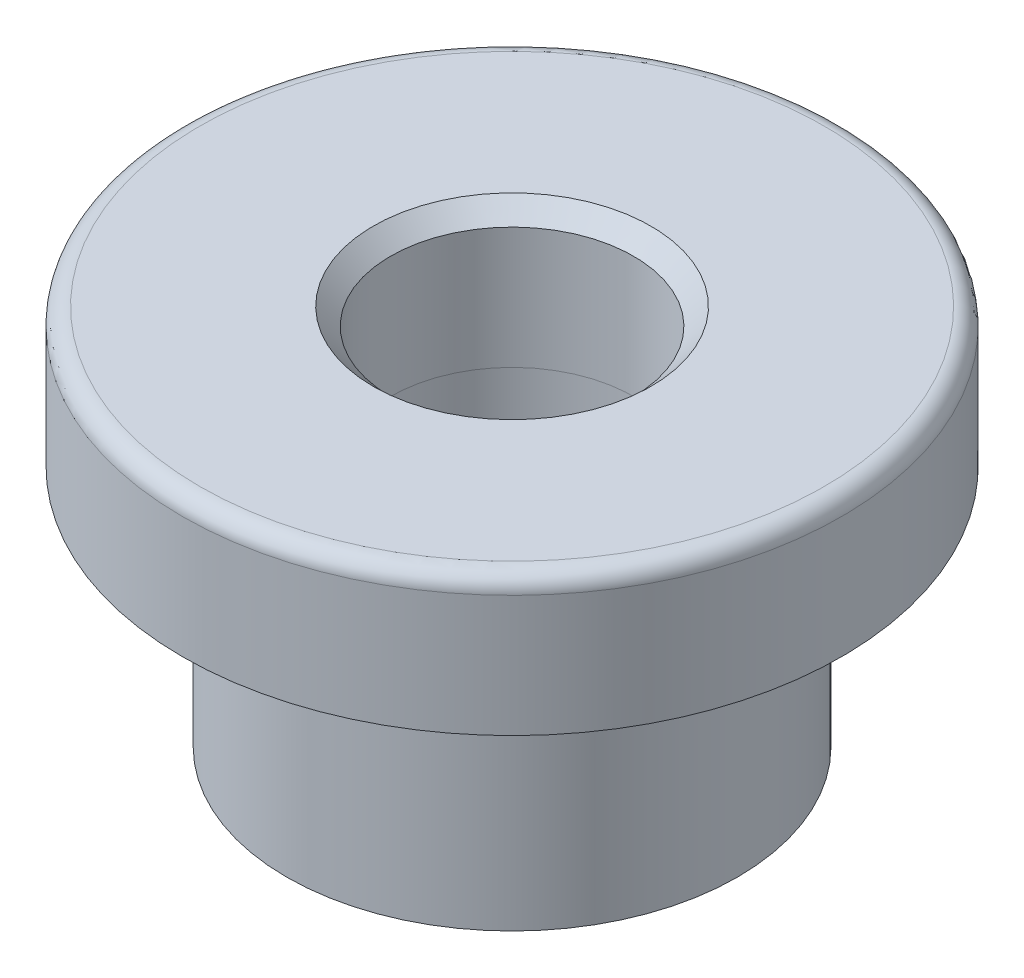
ISO-10303-21;
HEADER;
FILE_DESCRIPTION(('STEP AP214'),'2;1');
FILE_NAME('part.step','',(''),(''),'','','');
FILE_SCHEMA(('AUTOMOTIVE_DESIGN { 1 0 10303 214 1 1 1 1 }'));
ENDSEC;
DATA;
#1=APPLICATION_CONTEXT('core data for automotive mechanical design processes');
#2=APPLICATION_PROTOCOL_DEFINITION('international standard','automotive_design',2000,#1);
#3=PRODUCT_CONTEXT('',#1,'mechanical');
#4=PRODUCT('Part','Part','',(#3));
#5=PRODUCT_RELATED_PRODUCT_CATEGORY('part','',(#4));
#6=PRODUCT_DEFINITION_FORMATION('','',#4);
#7=PRODUCT_DEFINITION_CONTEXT('part definition',#1,'design');
#8=PRODUCT_DEFINITION('design','',#6,#7);
#9=PRODUCT_DEFINITION_SHAPE('','',#8);
#10=(LENGTH_UNIT() NAMED_UNIT(*) SI_UNIT(.MILLI.,.METRE.));
#11=(NAMED_UNIT(*) PLANE_ANGLE_UNIT() SI_UNIT($,.RADIAN.));
#12=(NAMED_UNIT(*) SI_UNIT($,.STERADIAN.) SOLID_ANGLE_UNIT());
#13=UNCERTAINTY_MEASURE_WITH_UNIT(LENGTH_MEASURE(1.E-05),#10,'distance_accuracy_value','');
#14=(GEOMETRIC_REPRESENTATION_CONTEXT(3) GLOBAL_UNCERTAINTY_ASSIGNED_CONTEXT((#13)) GLOBAL_UNIT_ASSIGNED_CONTEXT((#10,
#11,#12)) REPRESENTATION_CONTEXT('',''));
#15=CARTESIAN_POINT('',(0.,0.,0.));
#16=DIRECTION('',(0.,0.,1.));
#17=DIRECTION('',(1.,0.,0.));
#18=AXIS2_PLACEMENT_3D('',#15,#16,#17);
#19=CARTESIAN_POINT('',(0.,0.,0.));
#20=DIRECTION('',(0.,1.,0.));
#21=DIRECTION('',(0.,0.,1.));
#22=AXIS2_PLACEMENT_3D('',#19,#20,#21);
#23=PLANE('',#22);
#24=CARTESIAN_POINT('',(0.,0.,0.));
#25=DIRECTION('',(0.,1.,0.));
#26=DIRECTION('',(0.,0.,1.));
#27=AXIS2_PLACEMENT_3D('',#24,#25,#26);
#28=CIRCLE('',#27,6.5);
#29=CARTESIAN_POINT('',(0.,0.,6.5));
#30=VERTEX_POINT('',#29);
#31=EDGE_CURVE('E149',#30,#30,#28,.T.);
#32=ORIENTED_EDGE('',*,*,#31,.F.);
#33=EDGE_LOOP('',(#32));
#34=FACE_BOUND('',#33,.T.);
#35=CARTESIAN_POINT('',(0.,0.,0.));
#36=DIRECTION('',(0.,1.,0.));
#37=DIRECTION('',(0.,0.,1.));
#38=AXIS2_PLACEMENT_3D('',#35,#36,#37);
#39=CIRCLE('',#38,3.5);
#40=CARTESIAN_POINT('',(0.,0.,3.5));
#41=VERTEX_POINT('',#40);
#42=EDGE_CURVE('E125',#41,#41,#39,.T.);
#43=ORIENTED_EDGE('',*,*,#42,.T.);
#44=EDGE_LOOP('',(#43));
#45=FACE_BOUND('',#44,.T.);
#46=ADVANCED_FACE('F45',(#34,#45),#23,.F.);
#47=CARTESIAN_POINT('',(0.,7.,0.));
#48=DIRECTION('',(0.,-1.,0.));
#49=DIRECTION('',(0.,0.,-1.));
#50=AXIS2_PLACEMENT_3D('',#47,#48,#49);
#51=CYLINDRICAL_SURFACE('',#50,6.5);
#52=CARTESIAN_POINT('',(0.,7.,0.));
#53=DIRECTION('',(0.,1.,0.));
#54=DIRECTION('',(0.,0.,1.));
#55=AXIS2_PLACEMENT_3D('',#52,#53,#54);
#56=CIRCLE('',#55,6.5);
#57=CARTESIAN_POINT('',(0.,7.,6.5));
#58=VERTEX_POINT('',#57);
#59=EDGE_CURVE('E69',#58,#58,#56,.T.);
#60=ORIENTED_EDGE('',*,*,#59,.F.);
#61=EDGE_LOOP('',(#60));
#62=FACE_BOUND('',#61,.T.);
#63=ORIENTED_EDGE('',*,*,#31,.T.);
#64=EDGE_LOOP('',(#63));
#65=FACE_BOUND('',#64,.T.);
#66=ADVANCED_FACE('F87',(#62,#65),#51,.T.);
#67=CARTESIAN_POINT('',(0.,7.,0.));
#68=DIRECTION('',(0.,-1.,0.));
#69=DIRECTION('',(0.,0.,-1.));
#70=AXIS2_PLACEMENT_3D('',#67,#68,#69);
#71=CYLINDRICAL_SURFACE('',#70,3.5);
#72=CARTESIAN_POINT('',(0.,7.,0.));
#73=DIRECTION('',(0.,1.,0.));
#74=DIRECTION('',(0.,0.,1.));
#75=AXIS2_PLACEMENT_3D('',#72,#73,#74);
#76=CIRCLE('',#75,3.5);
#77=CARTESIAN_POINT('',(0.,7.,3.5));
#78=VERTEX_POINT('',#77);
#79=EDGE_CURVE('E116',#78,#78,#76,.T.);
#80=ORIENTED_EDGE('',*,*,#79,.T.);
#81=EDGE_LOOP('',(#80));
#82=FACE_BOUND('',#81,.T.);
#83=ORIENTED_EDGE('',*,*,#42,.F.);
#84=EDGE_LOOP('',(#83));
#85=FACE_BOUND('',#84,.T.);
#86=ADVANCED_FACE('F76',(#82,#85),#71,.F.);
#87=CARTESIAN_POINT('',(0.,11.,0.));
#88=DIRECTION('',(0.,1.,0.));
#89=DIRECTION('',(0.,0.,1.));
#90=AXIS2_PLACEMENT_3D('',#87,#88,#89);
#91=PLANE('',#90);
#92=CARTESIAN_POINT('',(0.,11.,0.));
#93=DIRECTION('',(0.,1.,0.));
#94=DIRECTION('',(0.,0.,1.));
#95=AXIS2_PLACEMENT_3D('',#92,#93,#94);
#96=CIRCLE('',#95,9.);
#97=CARTESIAN_POINT('',(0.,11.,9.));
#98=VERTEX_POINT('',#97);
#99=EDGE_CURVE('E53',#98,#98,#96,.T.);
#100=ORIENTED_EDGE('',*,*,#99,.T.);
#101=EDGE_LOOP('',(#100));
#102=FACE_BOUND('',#101,.T.);
#103=CARTESIAN_POINT('',(0.,11.,0.));
#104=DIRECTION('',(0.,1.,0.));
#105=DIRECTION('',(0.,0.,1.));
#106=AXIS2_PLACEMENT_3D('',#103,#104,#105);
#107=CIRCLE('',#106,4.00317407149296);
#108=CARTESIAN_POINT('',(0.,11.,4.00317407149296));
#109=VERTEX_POINT('',#108);
#110=EDGE_CURVE('E58',#109,#109,#107,.F.);
#111=ORIENTED_EDGE('',*,*,#110,.T.);
#112=EDGE_LOOP('',(#111));
#113=FACE_BOUND('',#112,.T.);
#114=ADVANCED_FACE('F86',(#102,#113),#91,.T.);
#115=CARTESIAN_POINT('',(0.,7.,0.));
#116=DIRECTION('',(0.,1.,0.));
#117=DIRECTION('',(0.,0.,1.));
#118=AXIS2_PLACEMENT_3D('',#115,#116,#117);
#119=PLANE('',#118);
#120=ORIENTED_EDGE('',*,*,#59,.T.);
#121=EDGE_LOOP('',(#120));
#122=FACE_BOUND('',#121,.T.);
#123=CARTESIAN_POINT('',(0.,7.,0.));
#124=DIRECTION('',(0.,1.,0.));
#125=DIRECTION('',(0.,0.,1.));
#126=AXIS2_PLACEMENT_3D('',#123,#124,#125);
#127=CIRCLE('',#126,9.5);
#128=CARTESIAN_POINT('',(0.,7.,9.5));
#129=VERTEX_POINT('',#128);
#130=EDGE_CURVE('E119',#129,#129,#127,.T.);
#131=ORIENTED_EDGE('',*,*,#130,.F.);
#132=EDGE_LOOP('',(#131));
#133=FACE_BOUND('',#132,.T.);
#134=ADVANCED_FACE('F134',(#122,#133),#119,.F.);
#135=CARTESIAN_POINT('',(0.,11.,0.));
#136=DIRECTION('',(0.,-1.,0.));
#137=DIRECTION('',(0.,0.,-1.));
#138=AXIS2_PLACEMENT_3D('',#135,#136,#137);
#139=CYLINDRICAL_SURFACE('',#138,9.5);
#140=CARTESIAN_POINT('',(0.,10.5,0.));
#141=DIRECTION('',(0.,1.,0.));
#142=DIRECTION('',(0.,0.,1.));
#143=AXIS2_PLACEMENT_3D('',#140,#141,#142);
#144=CIRCLE('',#143,9.5);
#145=CARTESIAN_POINT('',(0.,10.5,9.5));
#146=VERTEX_POINT('',#145);
#147=EDGE_CURVE('E10',#146,#146,#144,.F.);
#148=ORIENTED_EDGE('',*,*,#147,.T.);
#149=EDGE_LOOP('',(#148));
#150=FACE_BOUND('',#149,.T.);
#151=ORIENTED_EDGE('',*,*,#130,.T.);
#152=EDGE_LOOP('',(#151));
#153=FACE_BOUND('',#152,.T.);
#154=ADVANCED_FACE('F89',(#150,#153),#139,.T.);
#155=CARTESIAN_POINT('',(0.,11.,0.));
#156=DIRECTION('',(0.,-1.,0.));
#157=DIRECTION('',(0.,0.,-1.));
#158=AXIS2_PLACEMENT_3D('',#155,#156,#157);
#159=CYLINDRICAL_SURFACE('',#158,3.50317407149296);
#160=CARTESIAN_POINT('',(0.,10.5,0.));
#161=DIRECTION('',(0.,1.,0.));
#162=DIRECTION('',(0.,0.,1.));
#163=AXIS2_PLACEMENT_3D('',#160,#161,#162);
#164=CIRCLE('',#163,3.50317407149296);
#165=CARTESIAN_POINT('',(0.,10.5,3.50317407149296));
#166=VERTEX_POINT('',#165);
#167=EDGE_CURVE('E63',#166,#166,#164,.T.);
#168=ORIENTED_EDGE('',*,*,#167,.T.);
#169=EDGE_LOOP('',(#168));
#170=FACE_BOUND('',#169,.T.);
#171=ORIENTED_EDGE('',*,*,#79,.F.);
#172=EDGE_LOOP('',(#171));
#173=FACE_BOUND('',#172,.T.);
#174=ADVANCED_FACE('F101',(#170,#173),#159,.F.);
#175=CARTESIAN_POINT('',(0.,10.5,0.));
#176=DIRECTION('',(0.,1.,0.));
#177=DIRECTION('',(0.,0.,1.));
#178=AXIS2_PLACEMENT_3D('',#175,#176,#177);
#179=CONICAL_SURFACE('',#178,3.50317407149296,0.785398163397452);
#180=ORIENTED_EDGE('',*,*,#110,.F.);
#181=EDGE_LOOP('',(#180));
#182=FACE_BOUND('',#181,.T.);
#183=ORIENTED_EDGE('',*,*,#167,.F.);
#184=EDGE_LOOP('',(#183));
#185=FACE_BOUND('',#184,.T.);
#186=ADVANCED_FACE('F97',(#182,#185),#179,.F.);
#187=CARTESIAN_POINT('',(0.,10.5,0.));
#188=DIRECTION('',(0.,1.,0.));
#189=DIRECTION('',(0.,0.,1.));
#190=AXIS2_PLACEMENT_3D('',#187,#188,#189);
#191=TOROIDAL_SURFACE('',#190,9.,0.5);
#192=ORIENTED_EDGE('',*,*,#147,.F.);
#193=EDGE_LOOP('',(#192));
#194=FACE_BOUND('',#193,.T.);
#195=ORIENTED_EDGE('',*,*,#99,.F.);
#196=EDGE_LOOP('',(#195));
#197=FACE_BOUND('',#196,.T.);
#198=ADVANCED_FACE('F47',(#194,#197),#191,.T.);
#199=CLOSED_SHELL('',(#46,#66,#86,#114,#134,#154,#174,#186,#198));
#200=MANIFOLD_SOLID_BREP('B2',#199);
#201=ADVANCED_BREP_SHAPE_REPRESENTATION('',(#18,#200),#14);
#202=SHAPE_DEFINITION_REPRESENTATION(#9,#201);
ENDSEC;
END-ISO-10303-21;
